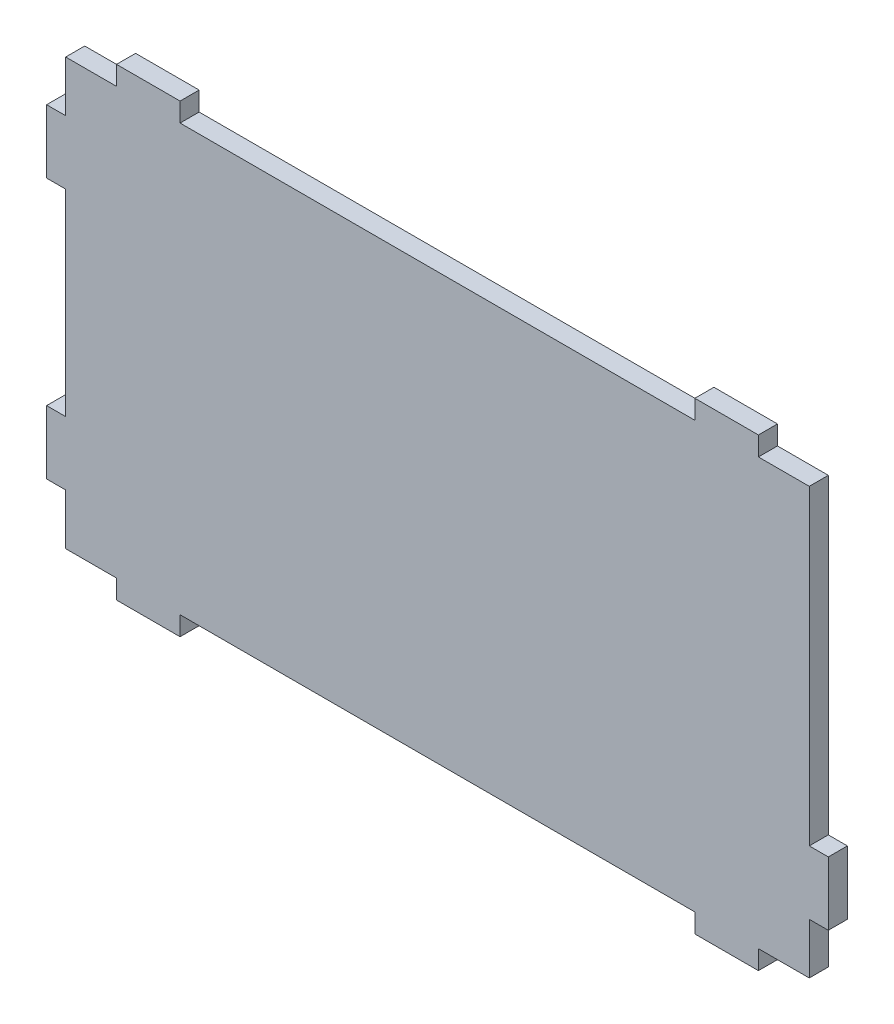
ISO-10303-21;
HEADER;
FILE_DESCRIPTION(('STEP AP214'),'2;1');
FILE_NAME('part.step','',(''),(''),'','','');
FILE_SCHEMA(('AUTOMOTIVE_DESIGN { 1 0 10303 214 1 1 1 1 }'));
ENDSEC;
DATA;
#1=APPLICATION_CONTEXT('core data for automotive mechanical design processes');
#2=APPLICATION_PROTOCOL_DEFINITION('international standard','automotive_design',2000,#1);
#3=PRODUCT_CONTEXT('',#1,'mechanical');
#4=PRODUCT('Part','Part','',(#3));
#5=PRODUCT_RELATED_PRODUCT_CATEGORY('part','',(#4));
#6=PRODUCT_DEFINITION_FORMATION('','',#4);
#7=PRODUCT_DEFINITION_CONTEXT('part definition',#1,'design');
#8=PRODUCT_DEFINITION('design','',#6,#7);
#9=PRODUCT_DEFINITION_SHAPE('','',#8);
#10=(LENGTH_UNIT() NAMED_UNIT(*) SI_UNIT(.MILLI.,.METRE.));
#11=(NAMED_UNIT(*) PLANE_ANGLE_UNIT() SI_UNIT($,.RADIAN.));
#12=(NAMED_UNIT(*) SI_UNIT($,.STERADIAN.) SOLID_ANGLE_UNIT());
#13=UNCERTAINTY_MEASURE_WITH_UNIT(LENGTH_MEASURE(1.E-05),#10,'distance_accuracy_value','');
#14=(GEOMETRIC_REPRESENTATION_CONTEXT(3) GLOBAL_UNCERTAINTY_ASSIGNED_CONTEXT((#13)) GLOBAL_UNIT_ASSIGNED_CONTEXT((#10,
#11,#12)) REPRESENTATION_CONTEXT('',''));
#15=CARTESIAN_POINT('',(0.,0.,0.));
#16=DIRECTION('',(0.,0.,1.));
#17=DIRECTION('',(1.,0.,0.));
#18=AXIS2_PLACEMENT_3D('',#15,#16,#17);
#19=CARTESIAN_POINT('',(-51.8752399232246,33.6238003838772,3.));
#20=DIRECTION('',(1.,0.,0.));
#21=DIRECTION('',(0.,1.,0.));
#22=AXIS2_PLACEMENT_3D('',#19,#20,#21);
#23=PLANE('',#22);
#24=DIRECTION('',(0.,-1.,0.));
#25=VECTOR('',#24,1.);
#26=CARTESIAN_POINT('',(-51.8752399232246,33.6238003838772,0.));
#27=LINE('',#26,#25);
#28=CARTESIAN_POINT('',(-51.8752399232246,33.6238003838772,0.));
#29=VERTEX_POINT('',#28);
#30=CARTESIAN_POINT('',(-51.8752399232246,25.6238003838772,0.));
#31=VERTEX_POINT('',#30);
#32=EDGE_CURVE('E273',#29,#31,#27,.T.);
#33=ORIENTED_EDGE('',*,*,#32,.T.);
#34=DIRECTION('',(0.,0.,-1.));
#35=VECTOR('',#34,1.);
#36=CARTESIAN_POINT('',(-51.8752399232246,25.6238003838772,3.));
#37=LINE('',#36,#35);
#38=CARTESIAN_POINT('',(-51.8752399232246,25.6238003838772,3.));
#39=VERTEX_POINT('',#38);
#40=EDGE_CURVE('E11',#39,#31,#37,.T.);
#41=ORIENTED_EDGE('',*,*,#40,.F.);
#42=DIRECTION('',(0.,-1.,0.));
#43=VECTOR('',#42,1.);
#44=CARTESIAN_POINT('',(-51.8752399232246,33.6238003838772,3.));
#45=LINE('',#44,#43);
#46=CARTESIAN_POINT('',(-51.8752399232246,33.6238003838772,3.));
#47=VERTEX_POINT('',#46);
#48=EDGE_CURVE('E335',#47,#39,#45,.T.);
#49=ORIENTED_EDGE('',*,*,#48,.F.);
#50=DIRECTION('',(0.,0.,-1.));
#51=VECTOR('',#50,1.);
#52=CARTESIAN_POINT('',(-51.8752399232246,33.6238003838772,3.));
#53=LINE('',#52,#51);
#54=EDGE_CURVE('E269',#47,#29,#53,.T.);
#55=ORIENTED_EDGE('',*,*,#54,.T.);
#56=EDGE_LOOP('',(#33,#41,#49,#55));
#57=FACE_BOUND('',#56,.T.);
#58=ADVANCED_FACE('F33',(#57),#23,.F.);
#59=CARTESIAN_POINT('',(-51.8752399232246,25.6238003838772,3.));
#60=DIRECTION('',(0.,-1.,0.));
#61=DIRECTION('',(0.,0.,-1.));
#62=AXIS2_PLACEMENT_3D('',#59,#60,#61);
#63=PLANE('',#62);
#64=DIRECTION('',(-1.,0.,0.));
#65=VECTOR('',#64,1.);
#66=CARTESIAN_POINT('',(-51.8752399232246,25.6238003838772,0.));
#67=LINE('',#66,#65);
#68=CARTESIAN_POINT('',(-54.8752399232246,25.6238003838772,0.));
#69=VERTEX_POINT('',#68);
#70=EDGE_CURVE('E276',#31,#69,#67,.T.);
#71=ORIENTED_EDGE('',*,*,#70,.T.);
#72=DIRECTION('',(0.,0.,-1.));
#73=VECTOR('',#72,1.);
#74=CARTESIAN_POINT('',(-54.8752399232246,25.6238003838772,3.));
#75=LINE('',#74,#73);
#76=CARTESIAN_POINT('',(-54.8752399232246,25.6238003838772,3.));
#77=VERTEX_POINT('',#76);
#78=EDGE_CURVE('E41',#77,#69,#75,.T.);
#79=ORIENTED_EDGE('',*,*,#78,.F.);
#80=DIRECTION('',(-1.,0.,0.));
#81=VECTOR('',#80,1.);
#82=CARTESIAN_POINT('',(-51.8752399232246,25.6238003838772,3.));
#83=LINE('',#82,#81);
#84=EDGE_CURVE('E164',#39,#77,#83,.T.);
#85=ORIENTED_EDGE('',*,*,#84,.F.);
#86=ORIENTED_EDGE('',*,*,#40,.T.);
#87=EDGE_LOOP('',(#71,#79,#85,#86));
#88=FACE_BOUND('',#87,.T.);
#89=ADVANCED_FACE('F513',(#88),#63,.F.);
#90=CARTESIAN_POINT('',(-54.8752399232246,25.6238003838772,3.));
#91=DIRECTION('',(1.,0.,0.));
#92=DIRECTION('',(0.,1.,0.));
#93=AXIS2_PLACEMENT_3D('',#90,#91,#92);
#94=PLANE('',#93);
#95=DIRECTION('',(0.,-1.,0.));
#96=VECTOR('',#95,1.);
#97=CARTESIAN_POINT('',(-54.8752399232246,25.6238003838772,0.));
#98=LINE('',#97,#96);
#99=CARTESIAN_POINT('',(-54.8752399232246,15.6238003838772,0.));
#100=VERTEX_POINT('',#99);
#101=EDGE_CURVE('E278',#69,#100,#98,.T.);
#102=ORIENTED_EDGE('',*,*,#101,.T.);
#103=DIRECTION('',(0.,0.,-1.));
#104=VECTOR('',#103,1.);
#105=CARTESIAN_POINT('',(-54.8752399232246,15.6238003838772,3.));
#106=LINE('',#105,#104);
#107=CARTESIAN_POINT('',(-54.8752399232246,15.6238003838772,3.));
#108=VERTEX_POINT('',#107);
#109=EDGE_CURVE('E414',#108,#100,#106,.T.);
#110=ORIENTED_EDGE('',*,*,#109,.F.);
#111=DIRECTION('',(0.,-1.,0.));
#112=VECTOR('',#111,1.);
#113=CARTESIAN_POINT('',(-54.8752399232246,25.6238003838772,3.));
#114=LINE('',#113,#112);
#115=EDGE_CURVE('E422',#77,#108,#114,.T.);
#116=ORIENTED_EDGE('',*,*,#115,.F.);
#117=ORIENTED_EDGE('',*,*,#78,.T.);
#118=EDGE_LOOP('',(#102,#110,#116,#117));
#119=FACE_BOUND('',#118,.T.);
#120=ADVANCED_FACE('F420',(#119),#94,.F.);
#121=CARTESIAN_POINT('',(-54.8752399232246,15.6238003838772,3.));
#122=DIRECTION('',(0.,1.,0.));
#123=DIRECTION('',(0.,0.,1.));
#124=AXIS2_PLACEMENT_3D('',#121,#122,#123);
#125=PLANE('',#124);
#126=DIRECTION('',(1.,0.,0.));
#127=VECTOR('',#126,1.);
#128=CARTESIAN_POINT('',(-54.8752399232246,15.6238003838772,0.));
#129=LINE('',#128,#127);
#130=CARTESIAN_POINT('',(-51.8752399232246,15.6238003838772,0.));
#131=VERTEX_POINT('',#130);
#132=EDGE_CURVE('E280',#100,#131,#129,.T.);
#133=ORIENTED_EDGE('',*,*,#132,.T.);
#134=DIRECTION('',(0.,0.,-1.));
#135=VECTOR('',#134,1.);
#136=CARTESIAN_POINT('',(-51.8752399232246,15.6238003838772,3.));
#137=LINE('',#136,#135);
#138=CARTESIAN_POINT('',(-51.8752399232246,15.6238003838772,3.));
#139=VERTEX_POINT('',#138);
#140=EDGE_CURVE('E411',#139,#131,#137,.T.);
#141=ORIENTED_EDGE('',*,*,#140,.F.);
#142=DIRECTION('',(1.,0.,0.));
#143=VECTOR('',#142,1.);
#144=CARTESIAN_POINT('',(-54.8752399232246,15.6238003838772,3.));
#145=LINE('',#144,#143);
#146=EDGE_CURVE('E440',#108,#139,#145,.T.);
#147=ORIENTED_EDGE('',*,*,#146,.F.);
#148=ORIENTED_EDGE('',*,*,#109,.T.);
#149=EDGE_LOOP('',(#133,#141,#147,#148));
#150=FACE_BOUND('',#149,.T.);
#151=ADVANCED_FACE('F431',(#150),#125,.F.);
#152=CARTESIAN_POINT('',(-51.8752399232246,15.6238003838772,3.));
#153=DIRECTION('',(1.,0.,0.));
#154=DIRECTION('',(0.,1.,0.));
#155=AXIS2_PLACEMENT_3D('',#152,#153,#154);
#156=PLANE('',#155);
#157=DIRECTION('',(0.,-1.,0.));
#158=VECTOR('',#157,1.);
#159=CARTESIAN_POINT('',(-51.8752399232246,15.6238003838772,0.));
#160=LINE('',#159,#158);
#161=CARTESIAN_POINT('',(-51.8752399232246,-15.3761996161228,0.));
#162=VERTEX_POINT('',#161);
#163=EDGE_CURVE('E282',#131,#162,#160,.T.);
#164=ORIENTED_EDGE('',*,*,#163,.T.);
#165=DIRECTION('',(0.,0.,-1.));
#166=VECTOR('',#165,1.);
#167=CARTESIAN_POINT('',(-51.8752399232246,-15.3761996161228,3.));
#168=LINE('',#167,#166);
#169=CARTESIAN_POINT('',(-51.8752399232246,-15.3761996161228,3.));
#170=VERTEX_POINT('',#169);
#171=EDGE_CURVE('E408',#170,#162,#168,.T.);
#172=ORIENTED_EDGE('',*,*,#171,.F.);
#173=DIRECTION('',(0.,-1.,0.));
#174=VECTOR('',#173,1.);
#175=CARTESIAN_POINT('',(-51.8752399232246,15.6238003838772,3.));
#176=LINE('',#175,#174);
#177=EDGE_CURVE('E437',#139,#170,#176,.T.);
#178=ORIENTED_EDGE('',*,*,#177,.F.);
#179=ORIENTED_EDGE('',*,*,#140,.T.);
#180=EDGE_LOOP('',(#164,#172,#178,#179));
#181=FACE_BOUND('',#180,.T.);
#182=ADVANCED_FACE('F435',(#181),#156,.F.);
#183=CARTESIAN_POINT('',(-51.8752399232246,-15.3761996161228,3.));
#184=DIRECTION('',(0.,-1.,0.));
#185=DIRECTION('',(0.,0.,-1.));
#186=AXIS2_PLACEMENT_3D('',#183,#184,#185);
#187=PLANE('',#186);
#188=DIRECTION('',(-1.,0.,0.));
#189=VECTOR('',#188,1.);
#190=CARTESIAN_POINT('',(-51.8752399232246,-15.3761996161228,0.));
#191=LINE('',#190,#189);
#192=CARTESIAN_POINT('',(-54.8752399232246,-15.3761996161228,0.));
#193=VERTEX_POINT('',#192);
#194=EDGE_CURVE('E284',#162,#193,#191,.T.);
#195=ORIENTED_EDGE('',*,*,#194,.T.);
#196=DIRECTION('',(0.,0.,-1.));
#197=VECTOR('',#196,1.);
#198=CARTESIAN_POINT('',(-54.8752399232246,-15.3761996161228,3.));
#199=LINE('',#198,#197);
#200=CARTESIAN_POINT('',(-54.8752399232246,-15.3761996161228,3.));
#201=VERTEX_POINT('',#200);
#202=EDGE_CURVE('E405',#201,#193,#199,.T.);
#203=ORIENTED_EDGE('',*,*,#202,.F.);
#204=DIRECTION('',(-1.,0.,0.));
#205=VECTOR('',#204,1.);
#206=CARTESIAN_POINT('',(-51.8752399232246,-15.3761996161228,3.));
#207=LINE('',#206,#205);
#208=EDGE_CURVE('E439',#170,#201,#207,.T.);
#209=ORIENTED_EDGE('',*,*,#208,.F.);
#210=ORIENTED_EDGE('',*,*,#171,.T.);
#211=EDGE_LOOP('',(#195,#203,#209,#210));
#212=FACE_BOUND('',#211,.T.);
#213=ADVANCED_FACE('F526',(#212),#187,.F.);
#214=CARTESIAN_POINT('',(-54.8752399232246,-15.3761996161228,3.));
#215=DIRECTION('',(1.,0.,0.));
#216=DIRECTION('',(0.,1.,0.));
#217=AXIS2_PLACEMENT_3D('',#214,#215,#216);
#218=PLANE('',#217);
#219=DIRECTION('',(0.,-1.,0.));
#220=VECTOR('',#219,1.);
#221=CARTESIAN_POINT('',(-54.8752399232246,-15.3761996161228,0.));
#222=LINE('',#221,#220);
#223=CARTESIAN_POINT('',(-54.8752399232245,-25.3761996161229,0.));
#224=VERTEX_POINT('',#223);
#225=EDGE_CURVE('E286',#193,#224,#222,.T.);
#226=ORIENTED_EDGE('',*,*,#225,.T.);
#227=DIRECTION('',(0.,0.,-1.));
#228=VECTOR('',#227,1.);
#229=CARTESIAN_POINT('',(-54.8752399232245,-25.3761996161229,3.));
#230=LINE('',#229,#228);
#231=CARTESIAN_POINT('',(-54.8752399232245,-25.3761996161229,3.));
#232=VERTEX_POINT('',#231);
#233=EDGE_CURVE('E402',#232,#224,#230,.T.);
#234=ORIENTED_EDGE('',*,*,#233,.F.);
#235=DIRECTION('',(0.,-1.,0.));
#236=VECTOR('',#235,1.);
#237=CARTESIAN_POINT('',(-54.8752399232246,-15.3761996161228,3.));
#238=LINE('',#237,#236);
#239=EDGE_CURVE('E442',#201,#232,#238,.T.);
#240=ORIENTED_EDGE('',*,*,#239,.F.);
#241=ORIENTED_EDGE('',*,*,#202,.T.);
#242=EDGE_LOOP('',(#226,#234,#240,#241));
#243=FACE_BOUND('',#242,.T.);
#244=ADVANCED_FACE('F529',(#243),#218,.F.);
#245=CARTESIAN_POINT('',(-54.8752399232245,-25.3761996161229,3.));
#246=DIRECTION('',(0.,1.,0.));
#247=DIRECTION('',(0.,0.,1.));
#248=AXIS2_PLACEMENT_3D('',#245,#246,#247);
#249=PLANE('',#248);
#250=DIRECTION('',(1.,0.,0.));
#251=VECTOR('',#250,1.);
#252=CARTESIAN_POINT('',(-54.8752399232245,-25.3761996161229,0.));
#253=LINE('',#252,#251);
#254=CARTESIAN_POINT('',(-51.8752399232246,-25.3761996161229,0.));
#255=VERTEX_POINT('',#254);
#256=EDGE_CURVE('E288',#224,#255,#253,.T.);
#257=ORIENTED_EDGE('',*,*,#256,.T.);
#258=DIRECTION('',(0.,0.,-1.));
#259=VECTOR('',#258,1.);
#260=CARTESIAN_POINT('',(-51.8752399232246,-25.3761996161229,3.));
#261=LINE('',#260,#259);
#262=CARTESIAN_POINT('',(-51.8752399232246,-25.3761996161229,3.));
#263=VERTEX_POINT('',#262);
#264=EDGE_CURVE('E399',#263,#255,#261,.T.);
#265=ORIENTED_EDGE('',*,*,#264,.F.);
#266=DIRECTION('',(1.,0.,0.));
#267=VECTOR('',#266,1.);
#268=CARTESIAN_POINT('',(-54.8752399232245,-25.3761996161229,3.));
#269=LINE('',#268,#267);
#270=EDGE_CURVE('E448',#232,#263,#269,.T.);
#271=ORIENTED_EDGE('',*,*,#270,.F.);
#272=ORIENTED_EDGE('',*,*,#233,.T.);
#273=EDGE_LOOP('',(#257,#265,#271,#272));
#274=FACE_BOUND('',#273,.T.);
#275=ADVANCED_FACE('F533',(#274),#249,.F.);
#276=CARTESIAN_POINT('',(-51.8752399232246,-25.3761996161229,3.));
#277=DIRECTION('',(1.,0.,0.));
#278=DIRECTION('',(0.,0.,-1.));
#279=AXIS2_PLACEMENT_3D('',#276,#277,#278);
#280=PLANE('',#279);
#281=DIRECTION('',(0.,-1.,0.));
#282=VECTOR('',#281,1.);
#283=CARTESIAN_POINT('',(-51.8752399232246,-25.3761996161229,0.));
#284=LINE('',#283,#282);
#285=CARTESIAN_POINT('',(-51.8752399232246,-33.3761996161228,0.));
#286=VERTEX_POINT('',#285);
#287=EDGE_CURVE('E290',#255,#286,#284,.T.);
#288=ORIENTED_EDGE('',*,*,#287,.T.);
#289=DIRECTION('',(0.,0.,-1.));
#290=VECTOR('',#289,1.);
#291=CARTESIAN_POINT('',(-51.8752399232246,-33.3761996161228,3.));
#292=LINE('',#291,#290);
#293=CARTESIAN_POINT('',(-51.8752399232246,-33.3761996161228,3.));
#294=VERTEX_POINT('',#293);
#295=EDGE_CURVE('E396',#294,#286,#292,.T.);
#296=ORIENTED_EDGE('',*,*,#295,.F.);
#297=DIRECTION('',(0.,-1.,0.));
#298=VECTOR('',#297,1.);
#299=CARTESIAN_POINT('',(-51.8752399232246,-25.3761996161229,3.));
#300=LINE('',#299,#298);
#301=EDGE_CURVE('E450',#263,#294,#300,.T.);
#302=ORIENTED_EDGE('',*,*,#301,.F.);
#303=ORIENTED_EDGE('',*,*,#264,.T.);
#304=EDGE_LOOP('',(#288,#296,#302,#303));
#305=FACE_BOUND('',#304,.T.);
#306=ADVANCED_FACE('F537',(#305),#280,.F.);
#307=CARTESIAN_POINT('',(-51.8752399232246,-33.3761996161228,3.));
#308=DIRECTION('',(0.,1.,0.));
#309=DIRECTION('',(0.,0.,1.));
#310=AXIS2_PLACEMENT_3D('',#307,#308,#309);
#311=PLANE('',#310);
#312=DIRECTION('',(1.,0.,0.));
#313=VECTOR('',#312,1.);
#314=CARTESIAN_POINT('',(-51.8752399232246,-33.3761996161228,0.));
#315=LINE('',#314,#313);
#316=CARTESIAN_POINT('',(-43.8752399232246,-33.3761996161228,0.));
#317=VERTEX_POINT('',#316);
#318=EDGE_CURVE('E292',#286,#317,#315,.T.);
#319=ORIENTED_EDGE('',*,*,#318,.T.);
#320=DIRECTION('',(0.,0.,-1.));
#321=VECTOR('',#320,1.);
#322=CARTESIAN_POINT('',(-43.8752399232246,-33.3761996161228,3.));
#323=LINE('',#322,#321);
#324=CARTESIAN_POINT('',(-43.8752399232246,-33.3761996161228,3.));
#325=VERTEX_POINT('',#324);
#326=EDGE_CURVE('E393',#325,#317,#323,.T.);
#327=ORIENTED_EDGE('',*,*,#326,.F.);
#328=DIRECTION('',(1.,0.,0.));
#329=VECTOR('',#328,1.);
#330=CARTESIAN_POINT('',(-51.8752399232246,-33.3761996161228,3.));
#331=LINE('',#330,#329);
#332=EDGE_CURVE('E452',#294,#325,#331,.T.);
#333=ORIENTED_EDGE('',*,*,#332,.F.);
#334=ORIENTED_EDGE('',*,*,#295,.T.);
#335=EDGE_LOOP('',(#319,#327,#333,#334));
#336=FACE_BOUND('',#335,.T.);
#337=ADVANCED_FACE('F541',(#336),#311,.F.);
#338=CARTESIAN_POINT('',(-43.8752399232246,-33.3761996161228,3.));
#339=DIRECTION('',(1.,0.,0.));
#340=DIRECTION('',(0.,0.,-1.));
#341=AXIS2_PLACEMENT_3D('',#338,#339,#340);
#342=PLANE('',#341);
#343=DIRECTION('',(0.,-1.,0.));
#344=VECTOR('',#343,1.);
#345=CARTESIAN_POINT('',(-43.8752399232246,-33.3761996161228,0.));
#346=LINE('',#345,#344);
#347=CARTESIAN_POINT('',(-43.8752399232246,-36.3761996161229,0.));
#348=VERTEX_POINT('',#347);
#349=EDGE_CURVE('E294',#317,#348,#346,.T.);
#350=ORIENTED_EDGE('',*,*,#349,.T.);
#351=DIRECTION('',(0.,0.,-1.));
#352=VECTOR('',#351,1.);
#353=CARTESIAN_POINT('',(-43.8752399232246,-36.3761996161229,3.));
#354=LINE('',#353,#352);
#355=CARTESIAN_POINT('',(-43.8752399232246,-36.3761996161229,3.));
#356=VERTEX_POINT('',#355);
#357=EDGE_CURVE('E390',#356,#348,#354,.T.);
#358=ORIENTED_EDGE('',*,*,#357,.F.);
#359=DIRECTION('',(0.,-1.,0.));
#360=VECTOR('',#359,1.);
#361=CARTESIAN_POINT('',(-43.8752399232246,-33.3761996161228,3.));
#362=LINE('',#361,#360);
#363=EDGE_CURVE('E454',#325,#356,#362,.T.);
#364=ORIENTED_EDGE('',*,*,#363,.F.);
#365=ORIENTED_EDGE('',*,*,#326,.T.);
#366=EDGE_LOOP('',(#350,#358,#364,#365));
#367=FACE_BOUND('',#366,.T.);
#368=ADVANCED_FACE('F545',(#367),#342,.F.);
#369=CARTESIAN_POINT('',(-43.8752399232246,-36.3761996161229,3.));
#370=DIRECTION('',(0.,1.,0.));
#371=DIRECTION('',(0.,0.,1.));
#372=AXIS2_PLACEMENT_3D('',#369,#370,#371);
#373=PLANE('',#372);
#374=DIRECTION('',(1.,0.,0.));
#375=VECTOR('',#374,1.);
#376=CARTESIAN_POINT('',(-43.8752399232246,-36.3761996161229,0.));
#377=LINE('',#376,#375);
#378=CARTESIAN_POINT('',(-33.8752399232246,-36.3761996161229,0.));
#379=VERTEX_POINT('',#378);
#380=EDGE_CURVE('E296',#348,#379,#377,.T.);
#381=ORIENTED_EDGE('',*,*,#380,.T.);
#382=DIRECTION('',(0.,0.,-1.));
#383=VECTOR('',#382,1.);
#384=CARTESIAN_POINT('',(-33.8752399232246,-36.3761996161229,3.));
#385=LINE('',#384,#383);
#386=CARTESIAN_POINT('',(-33.8752399232246,-36.3761996161229,3.));
#387=VERTEX_POINT('',#386);
#388=EDGE_CURVE('E387',#387,#379,#385,.T.);
#389=ORIENTED_EDGE('',*,*,#388,.F.);
#390=DIRECTION('',(1.,0.,0.));
#391=VECTOR('',#390,1.);
#392=CARTESIAN_POINT('',(-43.8752399232246,-36.3761996161229,3.));
#393=LINE('',#392,#391);
#394=EDGE_CURVE('E456',#356,#387,#393,.T.);
#395=ORIENTED_EDGE('',*,*,#394,.F.);
#396=ORIENTED_EDGE('',*,*,#357,.T.);
#397=EDGE_LOOP('',(#381,#389,#395,#396));
#398=FACE_BOUND('',#397,.T.);
#399=ADVANCED_FACE('F549',(#398),#373,.F.);
#400=CARTESIAN_POINT('',(-33.8752399232246,-36.3761996161229,3.));
#401=DIRECTION('',(-1.,0.,0.));
#402=DIRECTION('',(0.,-1.,0.));
#403=AXIS2_PLACEMENT_3D('',#400,#401,#402);
#404=PLANE('',#403);
#405=DIRECTION('',(0.,1.,0.));
#406=VECTOR('',#405,1.);
#407=CARTESIAN_POINT('',(-33.8752399232246,-36.3761996161229,0.));
#408=LINE('',#407,#406);
#409=CARTESIAN_POINT('',(-33.8752399232246,-33.3761996161228,0.));
#410=VERTEX_POINT('',#409);
#411=EDGE_CURVE('E298',#379,#410,#408,.T.);
#412=ORIENTED_EDGE('',*,*,#411,.T.);
#413=DIRECTION('',(0.,0.,-1.));
#414=VECTOR('',#413,1.);
#415=CARTESIAN_POINT('',(-33.8752399232246,-33.3761996161228,3.));
#416=LINE('',#415,#414);
#417=CARTESIAN_POINT('',(-33.8752399232246,-33.3761996161228,3.));
#418=VERTEX_POINT('',#417);
#419=EDGE_CURVE('E384',#418,#410,#416,.T.);
#420=ORIENTED_EDGE('',*,*,#419,.F.);
#421=DIRECTION('',(0.,1.,0.));
#422=VECTOR('',#421,1.);
#423=CARTESIAN_POINT('',(-33.8752399232246,-36.3761996161229,3.));
#424=LINE('',#423,#422);
#425=EDGE_CURVE('E458',#387,#418,#424,.T.);
#426=ORIENTED_EDGE('',*,*,#425,.F.);
#427=ORIENTED_EDGE('',*,*,#388,.T.);
#428=EDGE_LOOP('',(#412,#420,#426,#427));
#429=FACE_BOUND('',#428,.T.);
#430=ADVANCED_FACE('F553',(#429),#404,.F.);
#431=CARTESIAN_POINT('',(-33.8752399232246,-33.3761996161228,3.));
#432=DIRECTION('',(0.,1.,0.));
#433=DIRECTION('',(0.,0.,1.));
#434=AXIS2_PLACEMENT_3D('',#431,#432,#433);
#435=PLANE('',#434);
#436=DIRECTION('',(1.,0.,0.));
#437=VECTOR('',#436,1.);
#438=CARTESIAN_POINT('',(-33.8752399232246,-33.3761996161228,0.));
#439=LINE('',#438,#437);
#440=CARTESIAN_POINT('',(47.1247600767755,-33.3761996161228,0.));
#441=VERTEX_POINT('',#440);
#442=EDGE_CURVE('E300',#410,#441,#439,.T.);
#443=ORIENTED_EDGE('',*,*,#442,.T.);
#444=DIRECTION('',(0.,0.,-1.));
#445=VECTOR('',#444,1.);
#446=CARTESIAN_POINT('',(47.1247600767755,-33.3761996161228,3.));
#447=LINE('',#446,#445);
#448=CARTESIAN_POINT('',(47.1247600767755,-33.3761996161228,3.));
#449=VERTEX_POINT('',#448);
#450=EDGE_CURVE('E381',#449,#441,#447,.T.);
#451=ORIENTED_EDGE('',*,*,#450,.F.);
#452=DIRECTION('',(1.,0.,0.));
#453=VECTOR('',#452,1.);
#454=CARTESIAN_POINT('',(-33.8752399232246,-33.3761996161228,3.));
#455=LINE('',#454,#453);
#456=EDGE_CURVE('E460',#418,#449,#455,.T.);
#457=ORIENTED_EDGE('',*,*,#456,.F.);
#458=ORIENTED_EDGE('',*,*,#419,.T.);
#459=EDGE_LOOP('',(#443,#451,#457,#458));
#460=FACE_BOUND('',#459,.T.);
#461=ADVANCED_FACE('F557',(#460),#435,.F.);
#462=CARTESIAN_POINT('',(47.1247600767755,-33.3761996161228,3.));
#463=DIRECTION('',(1.,0.,0.));
#464=DIRECTION('',(0.,1.,0.));
#465=AXIS2_PLACEMENT_3D('',#462,#463,#464);
#466=PLANE('',#465);
#467=DIRECTION('',(0.,-1.,0.));
#468=VECTOR('',#467,1.);
#469=CARTESIAN_POINT('',(47.1247600767755,-33.3761996161228,0.));
#470=LINE('',#469,#468);
#471=CARTESIAN_POINT('',(47.1247600767755,-36.3761996161229,0.));
#472=VERTEX_POINT('',#471);
#473=EDGE_CURVE('E302',#441,#472,#470,.T.);
#474=ORIENTED_EDGE('',*,*,#473,.T.);
#475=DIRECTION('',(0.,0.,-1.));
#476=VECTOR('',#475,1.);
#477=CARTESIAN_POINT('',(47.1247600767755,-36.3761996161229,3.));
#478=LINE('',#477,#476);
#479=CARTESIAN_POINT('',(47.1247600767755,-36.3761996161229,3.));
#480=VERTEX_POINT('',#479);
#481=EDGE_CURVE('E378',#480,#472,#478,.T.);
#482=ORIENTED_EDGE('',*,*,#481,.F.);
#483=DIRECTION('',(0.,-1.,0.));
#484=VECTOR('',#483,1.);
#485=CARTESIAN_POINT('',(47.1247600767755,-33.3761996161228,3.));
#486=LINE('',#485,#484);
#487=EDGE_CURVE('E462',#449,#480,#486,.T.);
#488=ORIENTED_EDGE('',*,*,#487,.F.);
#489=ORIENTED_EDGE('',*,*,#450,.T.);
#490=EDGE_LOOP('',(#474,#482,#488,#489));
#491=FACE_BOUND('',#490,.T.);
#492=ADVANCED_FACE('F561',(#491),#466,.F.);
#493=CARTESIAN_POINT('',(47.1247600767755,-36.3761996161229,3.));
#494=DIRECTION('',(0.,1.,0.));
#495=DIRECTION('',(0.,0.,1.));
#496=AXIS2_PLACEMENT_3D('',#493,#494,#495);
#497=PLANE('',#496);
#498=DIRECTION('',(1.,0.,0.));
#499=VECTOR('',#498,1.);
#500=CARTESIAN_POINT('',(47.1247600767755,-36.3761996161229,0.));
#501=LINE('',#500,#499);
#502=CARTESIAN_POINT('',(57.1247600767755,-36.3761996161229,0.));
#503=VERTEX_POINT('',#502);
#504=EDGE_CURVE('E304',#472,#503,#501,.T.);
#505=ORIENTED_EDGE('',*,*,#504,.T.);
#506=DIRECTION('',(0.,0.,-1.));
#507=VECTOR('',#506,1.);
#508=CARTESIAN_POINT('',(57.1247600767755,-36.3761996161229,3.));
#509=LINE('',#508,#507);
#510=CARTESIAN_POINT('',(57.1247600767755,-36.3761996161229,3.));
#511=VERTEX_POINT('',#510);
#512=EDGE_CURVE('E375',#511,#503,#509,.T.);
#513=ORIENTED_EDGE('',*,*,#512,.F.);
#514=DIRECTION('',(1.,0.,0.));
#515=VECTOR('',#514,1.);
#516=CARTESIAN_POINT('',(47.1247600767755,-36.3761996161229,3.));
#517=LINE('',#516,#515);
#518=EDGE_CURVE('E464',#480,#511,#517,.T.);
#519=ORIENTED_EDGE('',*,*,#518,.F.);
#520=ORIENTED_EDGE('',*,*,#481,.T.);
#521=EDGE_LOOP('',(#505,#513,#519,#520));
#522=FACE_BOUND('',#521,.T.);
#523=ADVANCED_FACE('F565',(#522),#497,.F.);
#524=CARTESIAN_POINT('',(57.1247600767755,-36.3761996161229,3.));
#525=DIRECTION('',(-1.,0.,0.));
#526=DIRECTION('',(0.,-1.,0.));
#527=AXIS2_PLACEMENT_3D('',#524,#525,#526);
#528=PLANE('',#527);
#529=DIRECTION('',(0.,1.,0.));
#530=VECTOR('',#529,1.);
#531=CARTESIAN_POINT('',(57.1247600767755,-36.3761996161229,0.));
#532=LINE('',#531,#530);
#533=CARTESIAN_POINT('',(57.1247600767755,-33.3761996161228,0.));
#534=VERTEX_POINT('',#533);
#535=EDGE_CURVE('E306',#503,#534,#532,.T.);
#536=ORIENTED_EDGE('',*,*,#535,.T.);
#537=DIRECTION('',(0.,0.,-1.));
#538=VECTOR('',#537,1.);
#539=CARTESIAN_POINT('',(57.1247600767755,-33.3761996161228,3.));
#540=LINE('',#539,#538);
#541=CARTESIAN_POINT('',(57.1247600767755,-33.3761996161228,3.));
#542=VERTEX_POINT('',#541);
#543=EDGE_CURVE('E372',#542,#534,#540,.T.);
#544=ORIENTED_EDGE('',*,*,#543,.F.);
#545=DIRECTION('',(0.,1.,0.));
#546=VECTOR('',#545,1.);
#547=CARTESIAN_POINT('',(57.1247600767755,-36.3761996161229,3.));
#548=LINE('',#547,#546);
#549=EDGE_CURVE('E466',#511,#542,#548,.T.);
#550=ORIENTED_EDGE('',*,*,#549,.F.);
#551=ORIENTED_EDGE('',*,*,#512,.T.);
#552=EDGE_LOOP('',(#536,#544,#550,#551));
#553=FACE_BOUND('',#552,.T.);
#554=ADVANCED_FACE('F569',(#553),#528,.F.);
#555=CARTESIAN_POINT('',(57.1247600767755,-33.3761996161228,3.));
#556=DIRECTION('',(0.,1.,0.));
#557=DIRECTION('',(0.,0.,1.));
#558=AXIS2_PLACEMENT_3D('',#555,#556,#557);
#559=PLANE('',#558);
#560=DIRECTION('',(1.,0.,0.));
#561=VECTOR('',#560,1.);
#562=CARTESIAN_POINT('',(57.1247600767755,-33.3761996161228,0.));
#563=LINE('',#562,#561);
#564=CARTESIAN_POINT('',(65.1247600767755,-33.3761996161228,0.));
#565=VERTEX_POINT('',#564);
#566=EDGE_CURVE('E308',#534,#565,#563,.T.);
#567=ORIENTED_EDGE('',*,*,#566,.T.);
#568=DIRECTION('',(0.,0.,-1.));
#569=VECTOR('',#568,1.);
#570=CARTESIAN_POINT('',(65.1247600767755,-33.3761996161228,3.));
#571=LINE('',#570,#569);
#572=CARTESIAN_POINT('',(65.1247600767755,-33.3761996161228,3.));
#573=VERTEX_POINT('',#572);
#574=EDGE_CURVE('E369',#573,#565,#571,.T.);
#575=ORIENTED_EDGE('',*,*,#574,.F.);
#576=DIRECTION('',(1.,0.,0.));
#577=VECTOR('',#576,1.);
#578=CARTESIAN_POINT('',(57.1247600767755,-33.3761996161228,3.));
#579=LINE('',#578,#577);
#580=EDGE_CURVE('E468',#542,#573,#579,.T.);
#581=ORIENTED_EDGE('',*,*,#580,.F.);
#582=ORIENTED_EDGE('',*,*,#543,.T.);
#583=EDGE_LOOP('',(#567,#575,#581,#582));
#584=FACE_BOUND('',#583,.T.);
#585=ADVANCED_FACE('F573',(#584),#559,.F.);
#586=CARTESIAN_POINT('',(65.1247600767755,-33.3761996161228,3.));
#587=DIRECTION('',(-1.,0.,0.));
#588=DIRECTION('',(0.,0.,1.));
#589=AXIS2_PLACEMENT_3D('',#586,#587,#588);
#590=PLANE('',#589);
#591=DIRECTION('',(0.,1.,0.));
#592=VECTOR('',#591,1.);
#593=CARTESIAN_POINT('',(65.1247600767755,-33.3761996161228,0.));
#594=LINE('',#593,#592);
#595=CARTESIAN_POINT('',(65.1247600767755,-25.3761996161229,0.));
#596=VERTEX_POINT('',#595);
#597=EDGE_CURVE('E310',#565,#596,#594,.T.);
#598=ORIENTED_EDGE('',*,*,#597,.T.);
#599=DIRECTION('',(0.,0.,-1.));
#600=VECTOR('',#599,1.);
#601=CARTESIAN_POINT('',(65.1247600767755,-25.3761996161229,3.));
#602=LINE('',#601,#600);
#603=CARTESIAN_POINT('',(65.1247600767755,-25.3761996161229,3.));
#604=VERTEX_POINT('',#603);
#605=EDGE_CURVE('E366',#604,#596,#602,.T.);
#606=ORIENTED_EDGE('',*,*,#605,.F.);
#607=DIRECTION('',(0.,1.,0.));
#608=VECTOR('',#607,1.);
#609=CARTESIAN_POINT('',(65.1247600767755,-33.3761996161228,3.));
#610=LINE('',#609,#608);
#611=EDGE_CURVE('E470',#573,#604,#610,.T.);
#612=ORIENTED_EDGE('',*,*,#611,.F.);
#613=ORIENTED_EDGE('',*,*,#574,.T.);
#614=EDGE_LOOP('',(#598,#606,#612,#613));
#615=FACE_BOUND('',#614,.T.);
#616=ADVANCED_FACE('F577',(#615),#590,.F.);
#617=CARTESIAN_POINT('',(65.1247600767755,-25.3761996161229,3.));
#618=DIRECTION('',(0.,1.,0.));
#619=DIRECTION('',(0.,0.,1.));
#620=AXIS2_PLACEMENT_3D('',#617,#618,#619);
#621=PLANE('',#620);
#622=DIRECTION('',(1.,0.,0.));
#623=VECTOR('',#622,1.);
#624=CARTESIAN_POINT('',(65.1247600767755,-25.3761996161229,0.));
#625=LINE('',#624,#623);
#626=CARTESIAN_POINT('',(68.1247600767755,-25.3761996161229,0.));
#627=VERTEX_POINT('',#626);
#628=EDGE_CURVE('E312',#596,#627,#625,.T.);
#629=ORIENTED_EDGE('',*,*,#628,.T.);
#630=DIRECTION('',(0.,0.,-1.));
#631=VECTOR('',#630,1.);
#632=CARTESIAN_POINT('',(68.1247600767755,-25.3761996161229,3.));
#633=LINE('',#632,#631);
#634=CARTESIAN_POINT('',(68.1247600767755,-25.3761996161229,3.));
#635=VERTEX_POINT('',#634);
#636=EDGE_CURVE('E363',#635,#627,#633,.T.);
#637=ORIENTED_EDGE('',*,*,#636,.F.);
#638=DIRECTION('',(1.,0.,0.));
#639=VECTOR('',#638,1.);
#640=CARTESIAN_POINT('',(65.1247600767755,-25.3761996161229,3.));
#641=LINE('',#640,#639);
#642=EDGE_CURVE('E472',#604,#635,#641,.T.);
#643=ORIENTED_EDGE('',*,*,#642,.F.);
#644=ORIENTED_EDGE('',*,*,#605,.T.);
#645=EDGE_LOOP('',(#629,#637,#643,#644));
#646=FACE_BOUND('',#645,.T.);
#647=ADVANCED_FACE('F581',(#646),#621,.F.);
#648=CARTESIAN_POINT('',(68.1247600767755,-25.3761996161229,3.));
#649=DIRECTION('',(-1.,0.,0.));
#650=DIRECTION('',(0.,0.,1.));
#651=AXIS2_PLACEMENT_3D('',#648,#649,#650);
#652=PLANE('',#651);
#653=DIRECTION('',(0.,1.,0.));
#654=VECTOR('',#653,1.);
#655=CARTESIAN_POINT('',(68.1247600767755,-25.3761996161229,0.));
#656=LINE('',#655,#654);
#657=CARTESIAN_POINT('',(68.1247600767755,-15.3761996161228,0.));
#658=VERTEX_POINT('',#657);
#659=EDGE_CURVE('E314',#627,#658,#656,.T.);
#660=ORIENTED_EDGE('',*,*,#659,.T.);
#661=DIRECTION('',(0.,0.,-1.));
#662=VECTOR('',#661,1.);
#663=CARTESIAN_POINT('',(68.1247600767755,-15.3761996161228,3.));
#664=LINE('',#663,#662);
#665=CARTESIAN_POINT('',(68.1247600767755,-15.3761996161228,3.));
#666=VERTEX_POINT('',#665);
#667=EDGE_CURVE('E360',#666,#658,#664,.T.);
#668=ORIENTED_EDGE('',*,*,#667,.F.);
#669=DIRECTION('',(0.,1.,0.));
#670=VECTOR('',#669,1.);
#671=CARTESIAN_POINT('',(68.1247600767755,-25.3761996161229,3.));
#672=LINE('',#671,#670);
#673=EDGE_CURVE('E474',#635,#666,#672,.T.);
#674=ORIENTED_EDGE('',*,*,#673,.F.);
#675=ORIENTED_EDGE('',*,*,#636,.T.);
#676=EDGE_LOOP('',(#660,#668,#674,#675));
#677=FACE_BOUND('',#676,.T.);
#678=ADVANCED_FACE('F585',(#677),#652,.F.);
#679=CARTESIAN_POINT('',(68.1247600767755,-15.3761996161228,3.));
#680=DIRECTION('',(0.,-1.,0.));
#681=DIRECTION('',(0.,0.,-1.));
#682=AXIS2_PLACEMENT_3D('',#679,#680,#681);
#683=PLANE('',#682);
#684=DIRECTION('',(-1.,0.,0.));
#685=VECTOR('',#684,1.);
#686=CARTESIAN_POINT('',(68.1247600767755,-15.3761996161228,0.));
#687=LINE('',#686,#685);
#688=CARTESIAN_POINT('',(65.1247600767755,-15.3761996161228,0.));
#689=VERTEX_POINT('',#688);
#690=EDGE_CURVE('E316',#658,#689,#687,.T.);
#691=ORIENTED_EDGE('',*,*,#690,.T.);
#692=DIRECTION('',(0.,0.,-1.));
#693=VECTOR('',#692,1.);
#694=CARTESIAN_POINT('',(65.1247600767755,-15.3761996161228,3.));
#695=LINE('',#694,#693);
#696=CARTESIAN_POINT('',(65.1247600767755,-15.3761996161228,3.));
#697=VERTEX_POINT('',#696);
#698=EDGE_CURVE('E357',#697,#689,#695,.T.);
#699=ORIENTED_EDGE('',*,*,#698,.F.);
#700=DIRECTION('',(-1.,0.,0.));
#701=VECTOR('',#700,1.);
#702=CARTESIAN_POINT('',(68.1247600767755,-15.3761996161228,3.));
#703=LINE('',#702,#701);
#704=EDGE_CURVE('E476',#666,#697,#703,.T.);
#705=ORIENTED_EDGE('',*,*,#704,.F.);
#706=ORIENTED_EDGE('',*,*,#667,.T.);
#707=EDGE_LOOP('',(#691,#699,#705,#706));
#708=FACE_BOUND('',#707,.T.);
#709=ADVANCED_FACE('F589',(#708),#683,.F.);
#710=CARTESIAN_POINT('',(65.1247600767755,-15.3761996161228,3.));
#711=DIRECTION('',(-1.,0.,0.));
#712=DIRECTION('',(0.,-1.,0.));
#713=AXIS2_PLACEMENT_3D('',#710,#711,#712);
#714=PLANE('',#713);
#715=DIRECTION('',(0.,1.,0.));
#716=VECTOR('',#715,1.);
#717=CARTESIAN_POINT('',(65.1247600767755,-15.3761996161228,0.));
#718=LINE('',#717,#716);
#719=CARTESIAN_POINT('',(65.1247600767754,33.6238003838772,0.));
#720=VERTEX_POINT('',#719);
#721=EDGE_CURVE('E318',#689,#720,#718,.T.);
#722=ORIENTED_EDGE('',*,*,#721,.T.);
#723=DIRECTION('',(0.,0.,-1.));
#724=VECTOR('',#723,1.);
#725=CARTESIAN_POINT('',(65.1247600767754,33.6238003838772,3.));
#726=LINE('',#725,#724);
#727=CARTESIAN_POINT('',(65.1247600767754,33.6238003838772,3.));
#728=VERTEX_POINT('',#727);
#729=EDGE_CURVE('E354',#728,#720,#726,.T.);
#730=ORIENTED_EDGE('',*,*,#729,.F.);
#731=DIRECTION('',(0.,1.,0.));
#732=VECTOR('',#731,1.);
#733=CARTESIAN_POINT('',(65.1247600767755,-15.3761996161228,3.));
#734=LINE('',#733,#732);
#735=EDGE_CURVE('E478',#697,#728,#734,.T.);
#736=ORIENTED_EDGE('',*,*,#735,.F.);
#737=ORIENTED_EDGE('',*,*,#698,.T.);
#738=EDGE_LOOP('',(#722,#730,#736,#737));
#739=FACE_BOUND('',#738,.T.);
#740=ADVANCED_FACE('F593',(#739),#714,.F.);
#741=CARTESIAN_POINT('',(65.1247600767754,33.6238003838772,3.));
#742=DIRECTION('',(0.,-1.,0.));
#743=DIRECTION('',(0.,0.,-1.));
#744=AXIS2_PLACEMENT_3D('',#741,#742,#743);
#745=PLANE('',#744);
#746=DIRECTION('',(-1.,0.,0.));
#747=VECTOR('',#746,1.);
#748=CARTESIAN_POINT('',(65.1247600767754,33.6238003838772,0.));
#749=LINE('',#748,#747);
#750=CARTESIAN_POINT('',(57.1247600767755,33.6238003838772,0.));
#751=VERTEX_POINT('',#750);
#752=EDGE_CURVE('E320',#720,#751,#749,.T.);
#753=ORIENTED_EDGE('',*,*,#752,.T.);
#754=DIRECTION('',(0.,0.,-1.));
#755=VECTOR('',#754,1.);
#756=CARTESIAN_POINT('',(57.1247600767755,33.6238003838772,3.));
#757=LINE('',#756,#755);
#758=CARTESIAN_POINT('',(57.1247600767755,33.6238003838772,3.));
#759=VERTEX_POINT('',#758);
#760=EDGE_CURVE('E351',#759,#751,#757,.T.);
#761=ORIENTED_EDGE('',*,*,#760,.F.);
#762=DIRECTION('',(-1.,0.,0.));
#763=VECTOR('',#762,1.);
#764=CARTESIAN_POINT('',(65.1247600767754,33.6238003838772,3.));
#765=LINE('',#764,#763);
#766=EDGE_CURVE('E480',#728,#759,#765,.T.);
#767=ORIENTED_EDGE('',*,*,#766,.F.);
#768=ORIENTED_EDGE('',*,*,#729,.T.);
#769=EDGE_LOOP('',(#753,#761,#767,#768));
#770=FACE_BOUND('',#769,.T.);
#771=ADVANCED_FACE('F597',(#770),#745,.F.);
#772=CARTESIAN_POINT('',(57.1247600767755,33.6238003838772,3.));
#773=DIRECTION('',(-1.,0.,0.));
#774=DIRECTION('',(0.,0.,1.));
#775=AXIS2_PLACEMENT_3D('',#772,#773,#774);
#776=PLANE('',#775);
#777=DIRECTION('',(0.,1.,0.));
#778=VECTOR('',#777,1.);
#779=CARTESIAN_POINT('',(57.1247600767755,33.6238003838772,0.));
#780=LINE('',#779,#778);
#781=CARTESIAN_POINT('',(57.1247600767755,36.6238003838772,0.));
#782=VERTEX_POINT('',#781);
#783=EDGE_CURVE('E322',#751,#782,#780,.T.);
#784=ORIENTED_EDGE('',*,*,#783,.T.);
#785=DIRECTION('',(0.,0.,-1.));
#786=VECTOR('',#785,1.);
#787=CARTESIAN_POINT('',(57.1247600767755,36.6238003838772,3.));
#788=LINE('',#787,#786);
#789=CARTESIAN_POINT('',(57.1247600767755,36.6238003838772,3.));
#790=VERTEX_POINT('',#789);
#791=EDGE_CURVE('E348',#790,#782,#788,.T.);
#792=ORIENTED_EDGE('',*,*,#791,.F.);
#793=DIRECTION('',(0.,1.,0.));
#794=VECTOR('',#793,1.);
#795=CARTESIAN_POINT('',(57.1247600767755,33.6238003838772,3.));
#796=LINE('',#795,#794);
#797=EDGE_CURVE('E482',#759,#790,#796,.T.);
#798=ORIENTED_EDGE('',*,*,#797,.F.);
#799=ORIENTED_EDGE('',*,*,#760,.T.);
#800=EDGE_LOOP('',(#784,#792,#798,#799));
#801=FACE_BOUND('',#800,.T.);
#802=ADVANCED_FACE('F601',(#801),#776,.F.);
#803=CARTESIAN_POINT('',(57.1247600767755,36.6238003838772,3.));
#804=DIRECTION('',(0.,-1.,0.));
#805=DIRECTION('',(0.,0.,-1.));
#806=AXIS2_PLACEMENT_3D('',#803,#804,#805);
#807=PLANE('',#806);
#808=DIRECTION('',(-1.,0.,0.));
#809=VECTOR('',#808,1.);
#810=CARTESIAN_POINT('',(57.1247600767755,36.6238003838772,0.));
#811=LINE('',#810,#809);
#812=CARTESIAN_POINT('',(47.1247600767754,36.6238003838772,0.));
#813=VERTEX_POINT('',#812);
#814=EDGE_CURVE('E324',#782,#813,#811,.T.);
#815=ORIENTED_EDGE('',*,*,#814,.T.);
#816=DIRECTION('',(0.,0.,-1.));
#817=VECTOR('',#816,1.);
#818=CARTESIAN_POINT('',(47.1247600767754,36.6238003838772,3.));
#819=LINE('',#818,#817);
#820=CARTESIAN_POINT('',(47.1247600767754,36.6238003838772,3.));
#821=VERTEX_POINT('',#820);
#822=EDGE_CURVE('E345',#821,#813,#819,.T.);
#823=ORIENTED_EDGE('',*,*,#822,.F.);
#824=DIRECTION('',(-1.,0.,0.));
#825=VECTOR('',#824,1.);
#826=CARTESIAN_POINT('',(57.1247600767755,36.6238003838772,3.));
#827=LINE('',#826,#825);
#828=EDGE_CURVE('E484',#790,#821,#827,.T.);
#829=ORIENTED_EDGE('',*,*,#828,.F.);
#830=ORIENTED_EDGE('',*,*,#791,.T.);
#831=EDGE_LOOP('',(#815,#823,#829,#830));
#832=FACE_BOUND('',#831,.T.);
#833=ADVANCED_FACE('F605',(#832),#807,.F.);
#834=CARTESIAN_POINT('',(47.1247600767754,36.6238003838772,3.));
#835=DIRECTION('',(1.,0.,0.));
#836=DIRECTION('',(0.,0.,-1.));
#837=AXIS2_PLACEMENT_3D('',#834,#835,#836);
#838=PLANE('',#837);
#839=DIRECTION('',(0.,-1.,0.));
#840=VECTOR('',#839,1.);
#841=CARTESIAN_POINT('',(47.1247600767754,36.6238003838772,0.));
#842=LINE('',#841,#840);
#843=CARTESIAN_POINT('',(47.1247600767754,33.6238003838772,0.));
#844=VERTEX_POINT('',#843);
#845=EDGE_CURVE('E326',#813,#844,#842,.T.);
#846=ORIENTED_EDGE('',*,*,#845,.T.);
#847=DIRECTION('',(0.,0.,-1.));
#848=VECTOR('',#847,1.);
#849=CARTESIAN_POINT('',(47.1247600767754,33.6238003838772,3.));
#850=LINE('',#849,#848);
#851=CARTESIAN_POINT('',(47.1247600767754,33.6238003838772,3.));
#852=VERTEX_POINT('',#851);
#853=EDGE_CURVE('E342',#852,#844,#850,.T.);
#854=ORIENTED_EDGE('',*,*,#853,.F.);
#855=DIRECTION('',(0.,-1.,0.));
#856=VECTOR('',#855,1.);
#857=CARTESIAN_POINT('',(47.1247600767754,36.6238003838772,3.));
#858=LINE('',#857,#856);
#859=EDGE_CURVE('E486',#821,#852,#858,.T.);
#860=ORIENTED_EDGE('',*,*,#859,.F.);
#861=ORIENTED_EDGE('',*,*,#822,.T.);
#862=EDGE_LOOP('',(#846,#854,#860,#861));
#863=FACE_BOUND('',#862,.T.);
#864=ADVANCED_FACE('F609',(#863),#838,.F.);
#865=CARTESIAN_POINT('',(47.1247600767754,33.6238003838772,3.));
#866=DIRECTION('',(0.,-1.,0.));
#867=DIRECTION('',(0.,0.,-1.));
#868=AXIS2_PLACEMENT_3D('',#865,#866,#867);
#869=PLANE('',#868);
#870=DIRECTION('',(-1.,0.,0.));
#871=VECTOR('',#870,1.);
#872=CARTESIAN_POINT('',(47.1247600767754,33.6238003838772,0.));
#873=LINE('',#872,#871);
#874=CARTESIAN_POINT('',(-33.8752399232246,33.6238003838772,0.));
#875=VERTEX_POINT('',#874);
#876=EDGE_CURVE('E328',#844,#875,#873,.T.);
#877=ORIENTED_EDGE('',*,*,#876,.T.);
#878=DIRECTION('',(0.,0.,-1.));
#879=VECTOR('',#878,1.);
#880=CARTESIAN_POINT('',(-33.8752399232246,33.6238003838772,3.));
#881=LINE('',#880,#879);
#882=CARTESIAN_POINT('',(-33.8752399232246,33.6238003838772,3.));
#883=VERTEX_POINT('',#882);
#884=EDGE_CURVE('E339',#883,#875,#881,.T.);
#885=ORIENTED_EDGE('',*,*,#884,.F.);
#886=DIRECTION('',(-1.,0.,0.));
#887=VECTOR('',#886,1.);
#888=CARTESIAN_POINT('',(47.1247600767754,33.6238003838772,3.));
#889=LINE('',#888,#887);
#890=EDGE_CURVE('E488',#852,#883,#889,.T.);
#891=ORIENTED_EDGE('',*,*,#890,.F.);
#892=ORIENTED_EDGE('',*,*,#853,.T.);
#893=EDGE_LOOP('',(#877,#885,#891,#892));
#894=FACE_BOUND('',#893,.T.);
#895=ADVANCED_FACE('F494',(#894),#869,.F.);
#896=CARTESIAN_POINT('',(-33.8752399232246,33.6238003838772,3.));
#897=DIRECTION('',(-1.,0.,0.));
#898=DIRECTION('',(0.,0.,1.));
#899=AXIS2_PLACEMENT_3D('',#896,#897,#898);
#900=PLANE('',#899);
#901=DIRECTION('',(0.,1.,0.));
#902=VECTOR('',#901,1.);
#903=CARTESIAN_POINT('',(-33.8752399232246,33.6238003838772,0.));
#904=LINE('',#903,#902);
#905=CARTESIAN_POINT('',(-33.8752399232246,36.6238003838772,0.));
#906=VERTEX_POINT('',#905);
#907=EDGE_CURVE('E330',#875,#906,#904,.T.);
#908=ORIENTED_EDGE('',*,*,#907,.T.);
#909=DIRECTION('',(0.,0.,-1.));
#910=VECTOR('',#909,1.);
#911=CARTESIAN_POINT('',(-33.8752399232246,36.6238003838772,3.));
#912=LINE('',#911,#910);
#913=CARTESIAN_POINT('',(-33.8752399232246,36.6238003838772,3.));
#914=VERTEX_POINT('',#913);
#915=EDGE_CURVE('E264',#914,#906,#912,.T.);
#916=ORIENTED_EDGE('',*,*,#915,.F.);
#917=DIRECTION('',(0.,1.,0.));
#918=VECTOR('',#917,1.);
#919=CARTESIAN_POINT('',(-33.8752399232246,33.6238003838772,3.));
#920=LINE('',#919,#918);
#921=EDGE_CURVE('E255',#883,#914,#920,.T.);
#922=ORIENTED_EDGE('',*,*,#921,.F.);
#923=ORIENTED_EDGE('',*,*,#884,.T.);
#924=EDGE_LOOP('',(#908,#916,#922,#923));
#925=FACE_BOUND('',#924,.T.);
#926=ADVANCED_FACE('F498',(#925),#900,.F.);
#927=CARTESIAN_POINT('',(-33.8752399232246,36.6238003838772,3.));
#928=DIRECTION('',(0.,-1.,0.));
#929=DIRECTION('',(1.,0.,0.));
#930=AXIS2_PLACEMENT_3D('',#927,#928,#929);
#931=PLANE('',#930);
#932=DIRECTION('',(-1.,0.,0.));
#933=VECTOR('',#932,1.);
#934=CARTESIAN_POINT('',(-33.8752399232246,36.6238003838772,0.));
#935=LINE('',#934,#933);
#936=CARTESIAN_POINT('',(-43.8752399232246,36.6238003838772,0.));
#937=VERTEX_POINT('',#936);
#938=EDGE_CURVE('E263',#906,#937,#935,.T.);
#939=ORIENTED_EDGE('',*,*,#938,.T.);
#940=DIRECTION('',(0.,0.,-1.));
#941=VECTOR('',#940,1.);
#942=CARTESIAN_POINT('',(-43.8752399232246,36.6238003838772,3.));
#943=LINE('',#942,#941);
#944=CARTESIAN_POINT('',(-43.8752399232246,36.6238003838772,3.));
#945=VERTEX_POINT('',#944);
#946=EDGE_CURVE('E260',#945,#937,#943,.T.);
#947=ORIENTED_EDGE('',*,*,#946,.F.);
#948=DIRECTION('',(-1.,0.,0.));
#949=VECTOR('',#948,1.);
#950=CARTESIAN_POINT('',(-33.8752399232246,36.6238003838772,3.));
#951=LINE('',#950,#949);
#952=EDGE_CURVE('E249',#914,#945,#951,.T.);
#953=ORIENTED_EDGE('',*,*,#952,.F.);
#954=ORIENTED_EDGE('',*,*,#915,.T.);
#955=EDGE_LOOP('',(#939,#947,#953,#954));
#956=FACE_BOUND('',#955,.T.);
#957=ADVANCED_FACE('F261',(#956),#931,.F.);
#958=CARTESIAN_POINT('',(-43.8752399232246,36.6238003838772,3.));
#959=DIRECTION('',(1.,0.,0.));
#960=DIRECTION('',(0.,0.,-1.));
#961=AXIS2_PLACEMENT_3D('',#958,#959,#960);
#962=PLANE('',#961);
#963=DIRECTION('',(0.,-1.,0.));
#964=VECTOR('',#963,1.);
#965=CARTESIAN_POINT('',(-43.8752399232246,36.6238003838772,0.));
#966=LINE('',#965,#964);
#967=CARTESIAN_POINT('',(-43.8752399232246,33.6238003838772,0.));
#968=VERTEX_POINT('',#967);
#969=EDGE_CURVE('E150',#937,#968,#966,.T.);
#970=ORIENTED_EDGE('',*,*,#969,.T.);
#971=DIRECTION('',(0.,0.,-1.));
#972=VECTOR('',#971,1.);
#973=CARTESIAN_POINT('',(-43.8752399232246,33.6238003838772,3.));
#974=LINE('',#973,#972);
#975=CARTESIAN_POINT('',(-43.8752399232246,33.6238003838772,3.));
#976=VERTEX_POINT('',#975);
#977=EDGE_CURVE('E265',#976,#968,#974,.T.);
#978=ORIENTED_EDGE('',*,*,#977,.F.);
#979=DIRECTION('',(0.,-1.,0.));
#980=VECTOR('',#979,1.);
#981=CARTESIAN_POINT('',(-43.8752399232246,36.6238003838772,3.));
#982=LINE('',#981,#980);
#983=EDGE_CURVE('E253',#945,#976,#982,.T.);
#984=ORIENTED_EDGE('',*,*,#983,.F.);
#985=ORIENTED_EDGE('',*,*,#946,.T.);
#986=EDGE_LOOP('',(#970,#978,#984,#985));
#987=FACE_BOUND('',#986,.T.);
#988=ADVANCED_FACE('F267',(#987),#962,.F.);
#989=CARTESIAN_POINT('',(-43.8752399232246,33.6238003838772,3.));
#990=DIRECTION('',(0.,-1.,0.));
#991=DIRECTION('',(0.,0.,-1.));
#992=AXIS2_PLACEMENT_3D('',#989,#990,#991);
#993=PLANE('',#992);
#994=DIRECTION('',(-1.,0.,0.));
#995=VECTOR('',#994,1.);
#996=CARTESIAN_POINT('',(-43.8752399232246,33.6238003838772,0.));
#997=LINE('',#996,#995);
#998=EDGE_CURVE('E156',#968,#29,#997,.T.);
#999=ORIENTED_EDGE('',*,*,#998,.T.);
#1000=ORIENTED_EDGE('',*,*,#54,.F.);
#1001=DIRECTION('',(-1.,0.,0.));
#1002=VECTOR('',#1001,1.);
#1003=CARTESIAN_POINT('',(-43.8752399232246,33.6238003838772,3.));
#1004=LINE('',#1003,#1002);
#1005=EDGE_CURVE('E49',#976,#47,#1004,.T.);
#1006=ORIENTED_EDGE('',*,*,#1005,.F.);
#1007=ORIENTED_EDGE('',*,*,#977,.T.);
#1008=EDGE_LOOP('',(#999,#1000,#1006,#1007));
#1009=FACE_BOUND('',#1008,.T.);
#1010=ADVANCED_FACE('F502',(#1009),#993,.F.);
#1011=CARTESIAN_POINT('',(0.,0.,3.));
#1012=DIRECTION('',(0.,0.,-1.));
#1013=DIRECTION('',(-1.,0.,0.));
#1014=AXIS2_PLACEMENT_3D('',#1011,#1012,#1013);
#1015=PLANE('',#1014);
#1016=ORIENTED_EDGE('',*,*,#48,.T.);
#1017=ORIENTED_EDGE('',*,*,#84,.T.);
#1018=ORIENTED_EDGE('',*,*,#115,.T.);
#1019=ORIENTED_EDGE('',*,*,#146,.T.);
#1020=ORIENTED_EDGE('',*,*,#177,.T.);
#1021=ORIENTED_EDGE('',*,*,#208,.T.);
#1022=ORIENTED_EDGE('',*,*,#239,.T.);
#1023=ORIENTED_EDGE('',*,*,#270,.T.);
#1024=ORIENTED_EDGE('',*,*,#301,.T.);
#1025=ORIENTED_EDGE('',*,*,#332,.T.);
#1026=ORIENTED_EDGE('',*,*,#363,.T.);
#1027=ORIENTED_EDGE('',*,*,#394,.T.);
#1028=ORIENTED_EDGE('',*,*,#425,.T.);
#1029=ORIENTED_EDGE('',*,*,#456,.T.);
#1030=ORIENTED_EDGE('',*,*,#487,.T.);
#1031=ORIENTED_EDGE('',*,*,#518,.T.);
#1032=ORIENTED_EDGE('',*,*,#549,.T.);
#1033=ORIENTED_EDGE('',*,*,#580,.T.);
#1034=ORIENTED_EDGE('',*,*,#611,.T.);
#1035=ORIENTED_EDGE('',*,*,#642,.T.);
#1036=ORIENTED_EDGE('',*,*,#673,.T.);
#1037=ORIENTED_EDGE('',*,*,#704,.T.);
#1038=ORIENTED_EDGE('',*,*,#735,.T.);
#1039=ORIENTED_EDGE('',*,*,#766,.T.);
#1040=ORIENTED_EDGE('',*,*,#797,.T.);
#1041=ORIENTED_EDGE('',*,*,#828,.T.);
#1042=ORIENTED_EDGE('',*,*,#859,.T.);
#1043=ORIENTED_EDGE('',*,*,#890,.T.);
#1044=ORIENTED_EDGE('',*,*,#921,.T.);
#1045=ORIENTED_EDGE('',*,*,#952,.T.);
#1046=ORIENTED_EDGE('',*,*,#983,.T.);
#1047=ORIENTED_EDGE('',*,*,#1005,.T.);
#1048=EDGE_LOOP('',(#1016,#1017,#1018,#1019,#1020,#1021,#1022,#1023,#1024,#1025,#1026,#1027,
#1028,#1029,#1030,#1031,#1032,#1033,#1034,#1035,#1036,#1037,#1038,#1039,#1040,#1041,#1042,#1043,
#1044,#1045,#1046,#1047));
#1049=FACE_BOUND('',#1048,.T.);
#1050=ADVANCED_FACE('F251',(#1049),#1015,.F.);
#1051=CARTESIAN_POINT('',(0.,0.,0.));
#1052=DIRECTION('',(0.,0.,-1.));
#1053=DIRECTION('',(-1.,0.,0.));
#1054=AXIS2_PLACEMENT_3D('',#1051,#1052,#1053);
#1055=PLANE('',#1054);
#1056=ORIENTED_EDGE('',*,*,#32,.F.);
#1057=ORIENTED_EDGE('',*,*,#998,.F.);
#1058=ORIENTED_EDGE('',*,*,#969,.F.);
#1059=ORIENTED_EDGE('',*,*,#938,.F.);
#1060=ORIENTED_EDGE('',*,*,#907,.F.);
#1061=ORIENTED_EDGE('',*,*,#876,.F.);
#1062=ORIENTED_EDGE('',*,*,#845,.F.);
#1063=ORIENTED_EDGE('',*,*,#814,.F.);
#1064=ORIENTED_EDGE('',*,*,#783,.F.);
#1065=ORIENTED_EDGE('',*,*,#752,.F.);
#1066=ORIENTED_EDGE('',*,*,#721,.F.);
#1067=ORIENTED_EDGE('',*,*,#690,.F.);
#1068=ORIENTED_EDGE('',*,*,#659,.F.);
#1069=ORIENTED_EDGE('',*,*,#628,.F.);
#1070=ORIENTED_EDGE('',*,*,#597,.F.);
#1071=ORIENTED_EDGE('',*,*,#566,.F.);
#1072=ORIENTED_EDGE('',*,*,#535,.F.);
#1073=ORIENTED_EDGE('',*,*,#504,.F.);
#1074=ORIENTED_EDGE('',*,*,#473,.F.);
#1075=ORIENTED_EDGE('',*,*,#442,.F.);
#1076=ORIENTED_EDGE('',*,*,#411,.F.);
#1077=ORIENTED_EDGE('',*,*,#380,.F.);
#1078=ORIENTED_EDGE('',*,*,#349,.F.);
#1079=ORIENTED_EDGE('',*,*,#318,.F.);
#1080=ORIENTED_EDGE('',*,*,#287,.F.);
#1081=ORIENTED_EDGE('',*,*,#256,.F.);
#1082=ORIENTED_EDGE('',*,*,#225,.F.);
#1083=ORIENTED_EDGE('',*,*,#194,.F.);
#1084=ORIENTED_EDGE('',*,*,#163,.F.);
#1085=ORIENTED_EDGE('',*,*,#132,.F.);
#1086=ORIENTED_EDGE('',*,*,#101,.F.);
#1087=ORIENTED_EDGE('',*,*,#70,.F.);
#1088=EDGE_LOOP('',(#1056,#1057,#1058,#1059,#1060,#1061,#1062,#1063,#1064,#1065,#1066,#1067,
#1068,#1069,#1070,#1071,#1072,#1073,#1074,#1075,#1076,#1077,#1078,#1079,#1080,#1081,#1082,#1083,
#1084,#1085,#1086,#1087));
#1089=FACE_BOUND('',#1088,.T.);
#1090=ADVANCED_FACE('F426',(#1089),#1055,.T.);
#1091=CLOSED_SHELL('',(#58,#89,#120,#151,#182,#213,#244,#275,#306,#337,#368,#399,#430,#461,#492,
#523,#554,#585,#616,#647,#678,#709,#740,#771,#802,#833,#864,#895,#926,#957,#988,#1010,#1050,#1090));
#1092=MANIFOLD_SOLID_BREP('B2',#1091);
#1093=ADVANCED_BREP_SHAPE_REPRESENTATION('',(#18,#1092),#14);
#1094=SHAPE_DEFINITION_REPRESENTATION(#9,#1093);
ENDSEC;
END-ISO-10303-21;
